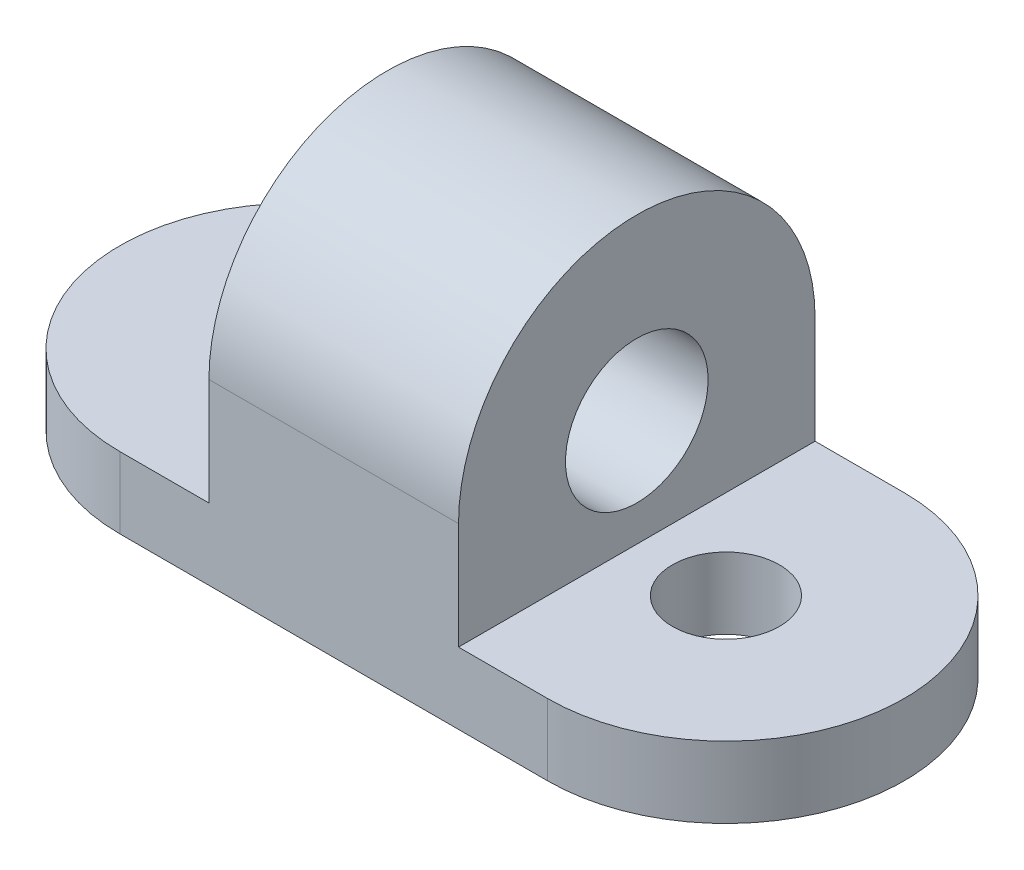
ISO-10303-21;
HEADER;
FILE_DESCRIPTION(('STEP AP214'),'2;1');
FILE_NAME('part.step','',(''),(''),'','','');
FILE_SCHEMA(('AUTOMOTIVE_DESIGN { 1 0 10303 214 1 1 1 1 }'));
ENDSEC;
DATA;
#1=APPLICATION_CONTEXT('core data for automotive mechanical design processes');
#2=APPLICATION_PROTOCOL_DEFINITION('international standard','automotive_design',2000,#1);
#3=PRODUCT_CONTEXT('',#1,'mechanical');
#4=PRODUCT('Part','Part','',(#3));
#5=PRODUCT_RELATED_PRODUCT_CATEGORY('part','',(#4));
#6=PRODUCT_DEFINITION_FORMATION('','',#4);
#7=PRODUCT_DEFINITION_CONTEXT('part definition',#1,'design');
#8=PRODUCT_DEFINITION('design','',#6,#7);
#9=PRODUCT_DEFINITION_SHAPE('','',#8);
#10=(LENGTH_UNIT() NAMED_UNIT(*) SI_UNIT(.MILLI.,.METRE.));
#11=(NAMED_UNIT(*) PLANE_ANGLE_UNIT() SI_UNIT($,.RADIAN.));
#12=(NAMED_UNIT(*) SI_UNIT($,.STERADIAN.) SOLID_ANGLE_UNIT());
#13=UNCERTAINTY_MEASURE_WITH_UNIT(LENGTH_MEASURE(1.E-05),#10,'distance_accuracy_value','');
#14=(GEOMETRIC_REPRESENTATION_CONTEXT(3) GLOBAL_UNCERTAINTY_ASSIGNED_CONTEXT((#13)) GLOBAL_UNIT_ASSIGNED_CONTEXT((#10,
#11,#12)) REPRESENTATION_CONTEXT('',''));
#15=CARTESIAN_POINT('',(0.,0.,0.));
#16=DIRECTION('',(0.,0.,1.));
#17=DIRECTION('',(1.,0.,0.));
#18=AXIS2_PLACEMENT_3D('',#15,#16,#17);
#19=CARTESIAN_POINT('',(-38.1,12.7,0.));
#20=DIRECTION('',(0.,-1.,0.));
#21=DIRECTION('',(0.,0.,-1.));
#22=AXIS2_PLACEMENT_3D('',#19,#20,#21);
#23=PLANE('',#22);
#24=CARTESIAN_POINT('',(-38.1,12.7,0.));
#25=DIRECTION('',(0.,1.,0.));
#26=DIRECTION('',(0.,0.,1.));
#27=AXIS2_PLACEMENT_3D('',#24,#25,#26);
#28=CIRCLE('',#27,9.525);
#29=CARTESIAN_POINT('',(-38.1,12.7,9.52500000000001));
#30=VERTEX_POINT('',#29);
#31=EDGE_CURVE('E151',#30,#30,#28,.T.);
#32=ORIENTED_EDGE('',*,*,#31,.F.);
#33=EDGE_LOOP('',(#32));
#34=FACE_BOUND('',#33,.T.);
#35=DIRECTION('',(0.,0.,1.));
#36=VECTOR('',#35,1.);
#37=CARTESIAN_POINT('',(-22.225,12.7,-31.75));
#38=LINE('',#37,#36);
#39=CARTESIAN_POINT('',(-22.225,12.7,-31.75));
#40=VERTEX_POINT('',#39);
#41=CARTESIAN_POINT('',(-22.225,12.7,31.75));
#42=VERTEX_POINT('',#41);
#43=EDGE_CURVE('E55',#40,#42,#38,.T.);
#44=ORIENTED_EDGE('',*,*,#43,.F.);
#45=DIRECTION('',(-1.,0.,0.));
#46=VECTOR('',#45,1.);
#47=CARTESIAN_POINT('',(-38.1,12.7,-31.75));
#48=LINE('',#47,#46);
#49=CARTESIAN_POINT('',(-38.1,12.7,-31.75));
#50=VERTEX_POINT('',#49);
#51=EDGE_CURVE('E166',#40,#50,#48,.T.);
#52=ORIENTED_EDGE('',*,*,#51,.T.);
#53=CARTESIAN_POINT('',(-38.1,12.7,0.));
#54=DIRECTION('',(0.,1.,0.));
#55=DIRECTION('',(0.,0.,-1.));
#56=AXIS2_PLACEMENT_3D('',#53,#54,#55);
#57=CIRCLE('',#56,31.75);
#58=CARTESIAN_POINT('',(-38.1,12.7,31.75));
#59=VERTEX_POINT('',#58);
#60=EDGE_CURVE('E157',#50,#59,#57,.T.);
#61=ORIENTED_EDGE('',*,*,#60,.T.);
#62=DIRECTION('',(1.,0.,0.));
#63=VECTOR('',#62,1.);
#64=CARTESIAN_POINT('',(38.1,12.7,31.75));
#65=LINE('',#64,#63);
#66=EDGE_CURVE('E162',#59,#42,#65,.T.);
#67=ORIENTED_EDGE('',*,*,#66,.T.);
#68=EDGE_LOOP('',(#44,#52,#61,#67));
#69=FACE_BOUND('',#68,.T.);
#70=ADVANCED_FACE('F40',(#34,#69),#23,.F.);
#71=CARTESIAN_POINT('',(38.1,12.7,0.));
#72=DIRECTION('',(0.,1.,0.));
#73=DIRECTION('',(0.,0.,1.));
#74=AXIS2_PLACEMENT_3D('',#71,#72,#73);
#75=CIRCLE('',#74,9.525);
#76=CARTESIAN_POINT('',(38.1,12.7,9.52500000000001));
#77=VERTEX_POINT('',#76);
#78=EDGE_CURVE('E145',#77,#77,#75,.T.);
#79=ORIENTED_EDGE('',*,*,#78,.F.);
#80=EDGE_LOOP('',(#79));
#81=FACE_BOUND('',#80,.T.);
#82=DIRECTION('',(0.,0.,-1.));
#83=VECTOR('',#82,1.);
#84=CARTESIAN_POINT('',(22.225,12.7,-31.75));
#85=LINE('',#84,#83);
#86=CARTESIAN_POINT('',(22.225,12.7,31.75));
#87=VERTEX_POINT('',#86);
#88=CARTESIAN_POINT('',(22.225,12.7,-31.75));
#89=VERTEX_POINT('',#88);
#90=EDGE_CURVE('E63',#87,#89,#85,.T.);
#91=ORIENTED_EDGE('',*,*,#90,.F.);
#92=CARTESIAN_POINT('',(38.1,12.7,31.75));
#93=VERTEX_POINT('',#92);
#94=EDGE_CURVE('E160',#87,#93,#65,.T.);
#95=ORIENTED_EDGE('',*,*,#94,.T.);
#96=CARTESIAN_POINT('',(38.1,12.7,0.));
#97=DIRECTION('',(0.,1.,0.));
#98=DIRECTION('',(0.,0.,1.));
#99=AXIS2_PLACEMENT_3D('',#96,#97,#98);
#100=CIRCLE('',#99,31.75);
#101=CARTESIAN_POINT('',(38.1,12.7,-31.75));
#102=VERTEX_POINT('',#101);
#103=EDGE_CURVE('E164',#93,#102,#100,.T.);
#104=ORIENTED_EDGE('',*,*,#103,.T.);
#105=EDGE_CURVE('E167',#102,#89,#48,.T.);
#106=ORIENTED_EDGE('',*,*,#105,.T.);
#107=EDGE_LOOP('',(#91,#95,#104,#106));
#108=FACE_BOUND('',#107,.T.);
#109=ADVANCED_FACE('F202',(#81,#108),#23,.F.);
#110=CARTESIAN_POINT('',(-38.1,0.,0.));
#111=DIRECTION('',(0.,-1.,0.));
#112=DIRECTION('',(0.,0.,-1.));
#113=AXIS2_PLACEMENT_3D('',#110,#111,#112);
#114=PLANE('',#113);
#115=CARTESIAN_POINT('',(-38.1,0.,0.));
#116=DIRECTION('',(0.,1.,0.));
#117=DIRECTION('',(0.,0.,1.));
#118=AXIS2_PLACEMENT_3D('',#115,#116,#117);
#119=CIRCLE('',#118,9.525);
#120=CARTESIAN_POINT('',(-38.1,0.,9.52500000000001));
#121=VERTEX_POINT('',#120);
#122=EDGE_CURVE('E148',#121,#121,#119,.T.);
#123=ORIENTED_EDGE('',*,*,#122,.T.);
#124=EDGE_LOOP('',(#123));
#125=FACE_BOUND('',#124,.T.);
#126=CARTESIAN_POINT('',(-38.1,0.,0.));
#127=DIRECTION('',(0.,1.,0.));
#128=DIRECTION('',(0.,0.,-1.));
#129=AXIS2_PLACEMENT_3D('',#126,#127,#128);
#130=CIRCLE('',#129,31.75);
#131=CARTESIAN_POINT('',(-38.1,0.,-31.75));
#132=VERTEX_POINT('',#131);
#133=CARTESIAN_POINT('',(-38.1,0.,31.75));
#134=VERTEX_POINT('',#133);
#135=EDGE_CURVE('E154',#132,#134,#130,.T.);
#136=ORIENTED_EDGE('',*,*,#135,.F.);
#137=DIRECTION('',(-1.,0.,0.));
#138=VECTOR('',#137,1.);
#139=CARTESIAN_POINT('',(-38.1,0.,-31.75));
#140=LINE('',#139,#138);
#141=CARTESIAN_POINT('',(38.1,0.,-31.75));
#142=VERTEX_POINT('',#141);
#143=EDGE_CURVE('E161',#142,#132,#140,.T.);
#144=ORIENTED_EDGE('',*,*,#143,.F.);
#145=CARTESIAN_POINT('',(38.1,0.,0.));
#146=DIRECTION('',(0.,1.,0.));
#147=DIRECTION('',(0.,0.,1.));
#148=AXIS2_PLACEMENT_3D('',#145,#146,#147);
#149=CIRCLE('',#148,31.75);
#150=CARTESIAN_POINT('',(38.1,0.,31.75));
#151=VERTEX_POINT('',#150);
#152=EDGE_CURVE('E174',#151,#142,#149,.T.);
#153=ORIENTED_EDGE('',*,*,#152,.F.);
#154=DIRECTION('',(1.,0.,0.));
#155=VECTOR('',#154,1.);
#156=CARTESIAN_POINT('',(38.1,0.,31.75));
#157=LINE('',#156,#155);
#158=EDGE_CURVE('E172',#134,#151,#157,.T.);
#159=ORIENTED_EDGE('',*,*,#158,.F.);
#160=EDGE_LOOP('',(#136,#144,#153,#159));
#161=FACE_BOUND('',#160,.T.);
#162=CARTESIAN_POINT('',(38.1,0.,0.));
#163=DIRECTION('',(0.,1.,0.));
#164=DIRECTION('',(0.,0.,1.));
#165=AXIS2_PLACEMENT_3D('',#162,#163,#164);
#166=CIRCLE('',#165,9.525);
#167=CARTESIAN_POINT('',(38.1,0.,9.52500000000001));
#168=VERTEX_POINT('',#167);
#169=EDGE_CURVE('E144',#168,#168,#166,.T.);
#170=ORIENTED_EDGE('',*,*,#169,.T.);
#171=EDGE_LOOP('',(#170));
#172=FACE_BOUND('',#171,.T.);
#173=ADVANCED_FACE('F192',(#125,#161,#172),#114,.T.);
#174=CARTESIAN_POINT('',(-38.1,12.7,0.));
#175=DIRECTION('',(0.,-1.,0.));
#176=DIRECTION('',(0.,0.,-1.));
#177=AXIS2_PLACEMENT_3D('',#174,#175,#176);
#178=CYLINDRICAL_SURFACE('',#177,31.75);
#179=ORIENTED_EDGE('',*,*,#135,.T.);
#180=DIRECTION('',(0.,-1.,0.));
#181=VECTOR('',#180,1.);
#182=CARTESIAN_POINT('',(-38.1,12.7,31.75));
#183=LINE('',#182,#181);
#184=EDGE_CURVE('E11',#59,#134,#183,.T.);
#185=ORIENTED_EDGE('',*,*,#184,.F.);
#186=ORIENTED_EDGE('',*,*,#60,.F.);
#187=DIRECTION('',(0.,-1.,0.));
#188=VECTOR('',#187,1.);
#189=CARTESIAN_POINT('',(-38.1,12.7,-31.75));
#190=LINE('',#189,#188);
#191=EDGE_CURVE('E169',#50,#132,#190,.T.);
#192=ORIENTED_EDGE('',*,*,#191,.T.);
#193=EDGE_LOOP('',(#179,#185,#186,#192));
#194=FACE_BOUND('',#193,.T.);
#195=ADVANCED_FACE('F42',(#194),#178,.T.);
#196=CARTESIAN_POINT('',(38.1,12.7,31.75));
#197=DIRECTION('',(0.,0.,-1.));
#198=DIRECTION('',(-1.,0.,0.));
#199=AXIS2_PLACEMENT_3D('',#196,#197,#198);
#200=PLANE('',#199);
#201=ORIENTED_EDGE('',*,*,#94,.F.);
#202=DIRECTION('',(0.,-1.,0.));
#203=VECTOR('',#202,1.);
#204=CARTESIAN_POINT('',(22.225,31.75,31.75));
#205=LINE('',#204,#203);
#206=CARTESIAN_POINT('',(22.225,31.75,31.75));
#207=VERTEX_POINT('',#206);
#208=EDGE_CURVE('E123',#207,#87,#205,.T.);
#209=ORIENTED_EDGE('',*,*,#208,.F.);
#210=DIRECTION('',(1.,0.,0.));
#211=VECTOR('',#210,1.);
#212=CARTESIAN_POINT('',(-22.225,31.75,31.75));
#213=LINE('',#212,#211);
#214=CARTESIAN_POINT('',(-22.225,31.75,31.75));
#215=VERTEX_POINT('',#214);
#216=EDGE_CURVE('E116',#215,#207,#213,.T.);
#217=ORIENTED_EDGE('',*,*,#216,.F.);
#218=DIRECTION('',(0.,-1.,0.));
#219=VECTOR('',#218,1.);
#220=CARTESIAN_POINT('',(-22.225,31.75,31.75));
#221=LINE('',#220,#219);
#222=EDGE_CURVE('E141',#215,#42,#221,.T.);
#223=ORIENTED_EDGE('',*,*,#222,.T.);
#224=ORIENTED_EDGE('',*,*,#66,.F.);
#225=ORIENTED_EDGE('',*,*,#184,.T.);
#226=ORIENTED_EDGE('',*,*,#158,.T.);
#227=DIRECTION('',(0.,-1.,0.));
#228=VECTOR('',#227,1.);
#229=CARTESIAN_POINT('',(38.1,12.7,31.75));
#230=LINE('',#229,#228);
#231=EDGE_CURVE('E48',#93,#151,#230,.T.);
#232=ORIENTED_EDGE('',*,*,#231,.F.);
#233=EDGE_LOOP('',(#201,#209,#217,#223,#224,#225,#226,#232));
#234=FACE_BOUND('',#233,.T.);
#235=ADVANCED_FACE('F201',(#234),#200,.F.);
#236=CARTESIAN_POINT('',(38.1,12.7,0.));
#237=DIRECTION('',(0.,-1.,0.));
#238=DIRECTION('',(0.,0.,-1.));
#239=AXIS2_PLACEMENT_3D('',#236,#237,#238);
#240=CYLINDRICAL_SURFACE('',#239,31.75);
#241=ORIENTED_EDGE('',*,*,#152,.T.);
#242=DIRECTION('',(0.,-1.,0.));
#243=VECTOR('',#242,1.);
#244=CARTESIAN_POINT('',(38.1,12.7,-31.75));
#245=LINE('',#244,#243);
#246=EDGE_CURVE('E179',#102,#142,#245,.T.);
#247=ORIENTED_EDGE('',*,*,#246,.F.);
#248=ORIENTED_EDGE('',*,*,#103,.F.);
#249=ORIENTED_EDGE('',*,*,#231,.T.);
#250=EDGE_LOOP('',(#241,#247,#248,#249));
#251=FACE_BOUND('',#250,.T.);
#252=ADVANCED_FACE('F186',(#251),#240,.T.);
#253=CARTESIAN_POINT('',(-38.1,12.7,-31.75));
#254=DIRECTION('',(0.,0.,1.));
#255=DIRECTION('',(1.,0.,0.));
#256=AXIS2_PLACEMENT_3D('',#253,#254,#255);
#257=PLANE('',#256);
#258=ORIENTED_EDGE('',*,*,#51,.F.);
#259=DIRECTION('',(0.,-1.,0.));
#260=VECTOR('',#259,1.);
#261=CARTESIAN_POINT('',(-22.225,31.75,-31.75));
#262=LINE('',#261,#260);
#263=CARTESIAN_POINT('',(-22.225,31.75,-31.75));
#264=VERTEX_POINT('',#263);
#265=EDGE_CURVE('E111',#264,#40,#262,.T.);
#266=ORIENTED_EDGE('',*,*,#265,.F.);
#267=DIRECTION('',(-1.,0.,0.));
#268=VECTOR('',#267,1.);
#269=CARTESIAN_POINT('',(-22.225,31.75,-31.75));
#270=LINE('',#269,#268);
#271=CARTESIAN_POINT('',(22.225,31.75,-31.75));
#272=VERTEX_POINT('',#271);
#273=EDGE_CURVE('E105',#272,#264,#270,.T.);
#274=ORIENTED_EDGE('',*,*,#273,.F.);
#275=DIRECTION('',(0.,-1.,0.));
#276=VECTOR('',#275,1.);
#277=CARTESIAN_POINT('',(22.225,31.75,-31.75));
#278=LINE('',#277,#276);
#279=EDGE_CURVE('E109',#272,#89,#278,.T.);
#280=ORIENTED_EDGE('',*,*,#279,.T.);
#281=ORIENTED_EDGE('',*,*,#105,.F.);
#282=ORIENTED_EDGE('',*,*,#246,.T.);
#283=ORIENTED_EDGE('',*,*,#143,.T.);
#284=ORIENTED_EDGE('',*,*,#191,.F.);
#285=EDGE_LOOP('',(#258,#266,#274,#280,#281,#282,#283,#284));
#286=FACE_BOUND('',#285,.T.);
#287=ADVANCED_FACE('F107',(#286),#257,.F.);
#288=CARTESIAN_POINT('',(-38.1,12.7,0.));
#289=DIRECTION('',(0.,-1.,0.));
#290=DIRECTION('',(0.,0.,-1.));
#291=AXIS2_PLACEMENT_3D('',#288,#289,#290);
#292=CYLINDRICAL_SURFACE('',#291,9.525);
#293=ORIENTED_EDGE('',*,*,#31,.T.);
#294=EDGE_LOOP('',(#293));
#295=FACE_BOUND('',#294,.T.);
#296=ORIENTED_EDGE('',*,*,#122,.F.);
#297=EDGE_LOOP('',(#296));
#298=FACE_BOUND('',#297,.T.);
#299=ADVANCED_FACE('F215',(#295,#298),#292,.F.);
#300=CARTESIAN_POINT('',(38.1,12.7,0.));
#301=DIRECTION('',(0.,-1.,0.));
#302=DIRECTION('',(0.,0.,-1.));
#303=AXIS2_PLACEMENT_3D('',#300,#301,#302);
#304=CYLINDRICAL_SURFACE('',#303,9.525);
#305=ORIENTED_EDGE('',*,*,#78,.T.);
#306=EDGE_LOOP('',(#305));
#307=FACE_BOUND('',#306,.T.);
#308=ORIENTED_EDGE('',*,*,#169,.F.);
#309=EDGE_LOOP('',(#308));
#310=FACE_BOUND('',#309,.T.);
#311=ADVANCED_FACE('F250',(#307,#310),#304,.F.);
#312=CARTESIAN_POINT('',(-22.225,31.75,-31.75));
#313=DIRECTION('',(1.,0.,0.));
#314=DIRECTION('',(0.,0.,-1.));
#315=AXIS2_PLACEMENT_3D('',#312,#313,#314);
#316=PLANE('',#315);
#317=CARTESIAN_POINT('',(-22.225,31.75,0.));
#318=DIRECTION('',(1.,0.,0.));
#319=DIRECTION('',(0.,0.,-1.));
#320=AXIS2_PLACEMENT_3D('',#317,#318,#319);
#321=CIRCLE('',#320,12.7);
#322=CARTESIAN_POINT('',(-22.225,31.75,-12.7));
#323=VERTEX_POINT('',#322);
#324=EDGE_CURVE('E128',#323,#323,#321,.T.);
#325=ORIENTED_EDGE('',*,*,#324,.T.);
#326=EDGE_LOOP('',(#325));
#327=FACE_BOUND('',#326,.T.);
#328=ORIENTED_EDGE('',*,*,#43,.T.);
#329=ORIENTED_EDGE('',*,*,#222,.F.);
#330=CARTESIAN_POINT('',(-22.225,31.75,0.));
#331=DIRECTION('',(1.,0.,0.));
#332=DIRECTION('',(0.,0.,1.));
#333=AXIS2_PLACEMENT_3D('',#330,#331,#332);
#334=CIRCLE('',#333,31.75);
#335=EDGE_CURVE('E127',#264,#215,#334,.T.);
#336=ORIENTED_EDGE('',*,*,#335,.F.);
#337=ORIENTED_EDGE('',*,*,#265,.T.);
#338=EDGE_LOOP('',(#328,#329,#336,#337));
#339=FACE_BOUND('',#338,.T.);
#340=ADVANCED_FACE('F199',(#327,#339),#316,.F.);
#341=CARTESIAN_POINT('',(22.225,31.75,-31.75));
#342=DIRECTION('',(-1.,0.,0.));
#343=DIRECTION('',(0.,0.,1.));
#344=AXIS2_PLACEMENT_3D('',#341,#342,#343);
#345=PLANE('',#344);
#346=CARTESIAN_POINT('',(22.225,31.75,0.));
#347=DIRECTION('',(1.,0.,0.));
#348=DIRECTION('',(0.,0.,-1.));
#349=AXIS2_PLACEMENT_3D('',#346,#347,#348);
#350=CIRCLE('',#349,12.7);
#351=CARTESIAN_POINT('',(22.225,31.75,-12.7));
#352=VERTEX_POINT('',#351);
#353=EDGE_CURVE('E132',#352,#352,#350,.T.);
#354=ORIENTED_EDGE('',*,*,#353,.F.);
#355=EDGE_LOOP('',(#354));
#356=FACE_BOUND('',#355,.T.);
#357=ORIENTED_EDGE('',*,*,#90,.T.);
#358=ORIENTED_EDGE('',*,*,#279,.F.);
#359=CARTESIAN_POINT('',(22.225,31.75,0.));
#360=DIRECTION('',(1.,0.,0.));
#361=DIRECTION('',(0.,0.,1.));
#362=AXIS2_PLACEMENT_3D('',#359,#360,#361);
#363=CIRCLE('',#362,31.75);
#364=EDGE_CURVE('E122',#272,#207,#363,.T.);
#365=ORIENTED_EDGE('',*,*,#364,.T.);
#366=ORIENTED_EDGE('',*,*,#208,.T.);
#367=EDGE_LOOP('',(#357,#358,#365,#366));
#368=FACE_BOUND('',#367,.T.);
#369=ADVANCED_FACE('F120',(#356,#368),#345,.F.);
#370=CARTESIAN_POINT('',(-22.225,31.75,0.));
#371=DIRECTION('',(1.,0.,0.));
#372=DIRECTION('',(0.,0.,-1.));
#373=AXIS2_PLACEMENT_3D('',#370,#371,#372);
#374=CYLINDRICAL_SURFACE('',#373,31.75);
#375=ORIENTED_EDGE('',*,*,#364,.F.);
#376=ORIENTED_EDGE('',*,*,#273,.T.);
#377=ORIENTED_EDGE('',*,*,#335,.T.);
#378=ORIENTED_EDGE('',*,*,#216,.T.);
#379=EDGE_LOOP('',(#375,#376,#377,#378));
#380=FACE_BOUND('',#379,.T.);
#381=ADVANCED_FACE('F126',(#380),#374,.T.);
#382=CARTESIAN_POINT('',(-22.225,31.75,0.));
#383=DIRECTION('',(1.,0.,0.));
#384=DIRECTION('',(0.,0.,-1.));
#385=AXIS2_PLACEMENT_3D('',#382,#383,#384);
#386=CYLINDRICAL_SURFACE('',#385,12.7);
#387=ORIENTED_EDGE('',*,*,#324,.F.);
#388=EDGE_LOOP('',(#387));
#389=FACE_BOUND('',#388,.T.);
#390=ORIENTED_EDGE('',*,*,#353,.T.);
#391=EDGE_LOOP('',(#390));
#392=FACE_BOUND('',#391,.T.);
#393=ADVANCED_FACE('F326',(#389,#392),#386,.F.);
#394=CLOSED_SHELL('',(#70,#109,#173,#195,#235,#252,#287,#299,#311,#340,#369,#381,#393));
#395=MANIFOLD_SOLID_BREP('B2',#394);
#396=ADVANCED_BREP_SHAPE_REPRESENTATION('',(#18,#395),#14);
#397=SHAPE_DEFINITION_REPRESENTATION(#9,#396);
ENDSEC;
END-ISO-10303-21;
